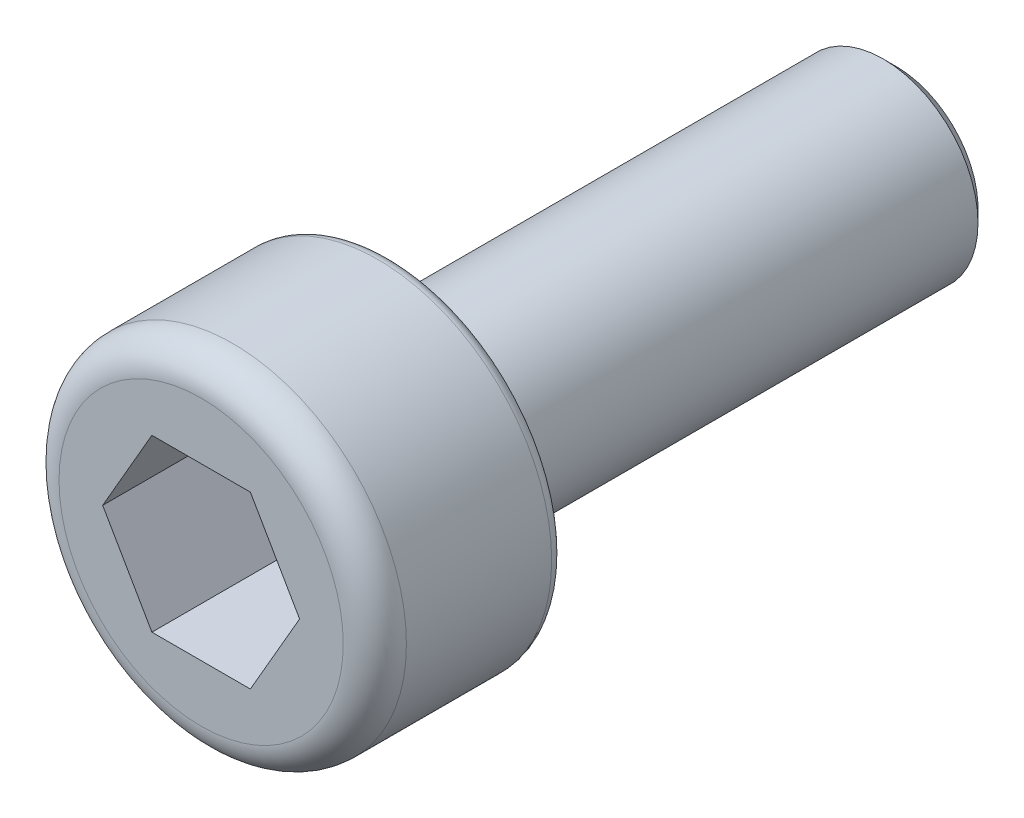
ISO-10303-21;
HEADER;
FILE_DESCRIPTION(('STEP AP214'),'2;1');
FILE_NAME('part.step','',(''),(''),'','','');
FILE_SCHEMA(('AUTOMOTIVE_DESIGN { 1 0 10303 214 1 1 1 1 }'));
ENDSEC;
DATA;
#1=APPLICATION_CONTEXT('core data for automotive mechanical design processes');
#2=APPLICATION_PROTOCOL_DEFINITION('international standard','automotive_design',2000,#1);
#3=PRODUCT_CONTEXT('',#1,'mechanical');
#4=PRODUCT('Part','Part','',(#3));
#5=PRODUCT_RELATED_PRODUCT_CATEGORY('part','',(#4));
#6=PRODUCT_DEFINITION_FORMATION('','',#4);
#7=PRODUCT_DEFINITION_CONTEXT('part definition',#1,'design');
#8=PRODUCT_DEFINITION('design','',#6,#7);
#9=PRODUCT_DEFINITION_SHAPE('','',#8);
#10=(LENGTH_UNIT() NAMED_UNIT(*) SI_UNIT(.MILLI.,.METRE.));
#11=(NAMED_UNIT(*) PLANE_ANGLE_UNIT() SI_UNIT($,.RADIAN.));
#12=(NAMED_UNIT(*) SI_UNIT($,.STERADIAN.) SOLID_ANGLE_UNIT());
#13=UNCERTAINTY_MEASURE_WITH_UNIT(LENGTH_MEASURE(1.E-05),#10,'distance_accuracy_value','');
#14=(GEOMETRIC_REPRESENTATION_CONTEXT(3) GLOBAL_UNCERTAINTY_ASSIGNED_CONTEXT((#13)) GLOBAL_UNIT_ASSIGNED_CONTEXT((#10,
#11,#12)) REPRESENTATION_CONTEXT('',''));
#15=CARTESIAN_POINT('',(0.,0.,0.));
#16=DIRECTION('',(0.,0.,1.));
#17=DIRECTION('',(1.,0.,0.));
#18=AXIS2_PLACEMENT_3D('',#15,#16,#17);
#19=CARTESIAN_POINT('',(0.,0.,0.));
#20=DIRECTION('',(0.,0.,1.));
#21=DIRECTION('',(1.,0.,0.));
#22=AXIS2_PLACEMENT_3D('',#19,#20,#21);
#23=PLANE('',#22);
#24=CARTESIAN_POINT('',(0.,0.,0.));
#25=DIRECTION('',(0.,0.,1.));
#26=DIRECTION('',(1.,0.,0.));
#27=AXIS2_PLACEMENT_3D('',#24,#25,#26);
#28=CIRCLE('',#27,2.55);
#29=CARTESIAN_POINT('',(2.55,0.,0.));
#30=VERTEX_POINT('',#29);
#31=EDGE_CURVE('E11',#30,#30,#28,.F.);
#32=ORIENTED_EDGE('',*,*,#31,.T.);
#33=EDGE_LOOP('',(#32));
#34=FACE_BOUND('',#33,.T.);
#35=CARTESIAN_POINT('',(0.,0.,0.));
#36=DIRECTION('',(0.,0.,1.));
#37=DIRECTION('',(1.,0.,0.));
#38=AXIS2_PLACEMENT_3D('',#35,#36,#37);
#39=CIRCLE('',#38,1.5);
#40=CARTESIAN_POINT('',(1.5,0.,0.));
#41=VERTEX_POINT('',#40);
#42=EDGE_CURVE('E147',#41,#41,#39,.F.);
#43=ORIENTED_EDGE('',*,*,#42,.F.);
#44=EDGE_LOOP('',(#43));
#45=FACE_BOUND('',#44,.T.);
#46=ADVANCED_FACE('F34',(#34,#45),#23,.F.);
#47=CARTESIAN_POINT('',(0.,0.,3.));
#48=DIRECTION('',(0.,0.,-1.));
#49=DIRECTION('',(-1.,0.,0.));
#50=AXIS2_PLACEMENT_3D('',#47,#48,#49);
#51=CYLINDRICAL_SURFACE('',#50,2.75);
#52=CARTESIAN_POINT('',(0.,0.,0.2));
#53=DIRECTION('',(0.,0.,1.));
#54=DIRECTION('',(1.,0.,0.));
#55=AXIS2_PLACEMENT_3D('',#52,#53,#54);
#56=CIRCLE('',#55,2.75);
#57=CARTESIAN_POINT('',(2.75,0.,0.2));
#58=VERTEX_POINT('',#57);
#59=EDGE_CURVE('E42',#58,#58,#56,.T.);
#60=ORIENTED_EDGE('',*,*,#59,.T.);
#61=EDGE_LOOP('',(#60));
#62=FACE_BOUND('',#61,.T.);
#63=CARTESIAN_POINT('',(0.,0.,2.5));
#64=DIRECTION('',(0.,0.,1.));
#65=DIRECTION('',(1.,0.,0.));
#66=AXIS2_PLACEMENT_3D('',#63,#64,#65);
#67=CIRCLE('',#66,2.75);
#68=CARTESIAN_POINT('',(2.75,0.,2.5));
#69=VERTEX_POINT('',#68);
#70=EDGE_CURVE('E144',#69,#69,#67,.F.);
#71=ORIENTED_EDGE('',*,*,#70,.T.);
#72=EDGE_LOOP('',(#71));
#73=FACE_BOUND('',#72,.T.);
#74=ADVANCED_FACE('F158',(#62,#73),#51,.T.);
#75=CARTESIAN_POINT('',(0.,0.,3.));
#76=DIRECTION('',(0.,0.,1.));
#77=DIRECTION('',(1.,0.,0.));
#78=AXIS2_PLACEMENT_3D('',#75,#76,#77);
#79=PLANE('',#78);
#80=DIRECTION('',(0.5,0.866025403784439,0.));
#81=VECTOR('',#80,1.);
#82=CARTESIAN_POINT('',(0.779422863405995,-1.35,3.));
#83=LINE('',#82,#81);
#84=CARTESIAN_POINT('',(0.779422863405995,-1.35,3.));
#85=VERTEX_POINT('',#84);
#86=CARTESIAN_POINT('',(1.55884572681199,0.,3.));
#87=VERTEX_POINT('',#86);
#88=EDGE_CURVE('E49',#85,#87,#83,.T.);
#89=ORIENTED_EDGE('',*,*,#88,.F.);
#90=DIRECTION('',(1.,0.,0.));
#91=VECTOR('',#90,1.);
#92=CARTESIAN_POINT('',(-0.779422863405994,-1.35,3.));
#93=LINE('',#92,#91);
#94=CARTESIAN_POINT('',(-0.779422863405994,-1.35,3.));
#95=VERTEX_POINT('',#94);
#96=EDGE_CURVE('E132',#95,#85,#93,.T.);
#97=ORIENTED_EDGE('',*,*,#96,.F.);
#98=DIRECTION('',(0.5,-0.866025403784438,0.));
#99=VECTOR('',#98,1.);
#100=CARTESIAN_POINT('',(-1.55884572681199,0.,3.));
#101=LINE('',#100,#99);
#102=CARTESIAN_POINT('',(-1.55884572681199,0.,3.));
#103=VERTEX_POINT('',#102);
#104=EDGE_CURVE('E130',#103,#95,#101,.T.);
#105=ORIENTED_EDGE('',*,*,#104,.F.);
#106=DIRECTION('',(-0.5,-0.866025403784438,0.));
#107=VECTOR('',#106,1.);
#108=CARTESIAN_POINT('',(-0.779422863405995,1.35,3.));
#109=LINE('',#108,#107);
#110=CARTESIAN_POINT('',(-0.779422863405995,1.35,3.));
#111=VERTEX_POINT('',#110);
#112=EDGE_CURVE('E97',#111,#103,#109,.T.);
#113=ORIENTED_EDGE('',*,*,#112,.F.);
#114=DIRECTION('',(-1.,0.,0.));
#115=VECTOR('',#114,1.);
#116=CARTESIAN_POINT('',(0.779422863405994,1.35,3.));
#117=LINE('',#116,#115);
#118=CARTESIAN_POINT('',(0.779422863405994,1.35,3.));
#119=VERTEX_POINT('',#118);
#120=EDGE_CURVE('E126',#119,#111,#117,.T.);
#121=ORIENTED_EDGE('',*,*,#120,.F.);
#122=DIRECTION('',(-0.5,0.866025403784438,0.));
#123=VECTOR('',#122,1.);
#124=CARTESIAN_POINT('',(1.55884572681199,0.,3.));
#125=LINE('',#124,#123);
#126=EDGE_CURVE('E123',#87,#119,#125,.T.);
#127=ORIENTED_EDGE('',*,*,#126,.F.);
#128=EDGE_LOOP('',(#89,#97,#105,#113,#121,#127));
#129=FACE_BOUND('',#128,.T.);
#130=CARTESIAN_POINT('',(0.,0.,3.));
#131=DIRECTION('',(0.,0.,1.));
#132=DIRECTION('',(1.,0.,0.));
#133=AXIS2_PLACEMENT_3D('',#130,#131,#132);
#134=CIRCLE('',#133,2.25);
#135=CARTESIAN_POINT('',(2.25,0.,3.));
#136=VERTEX_POINT('',#135);
#137=EDGE_CURVE('E136',#136,#136,#134,.T.);
#138=ORIENTED_EDGE('',*,*,#137,.T.);
#139=EDGE_LOOP('',(#138));
#140=FACE_BOUND('',#139,.T.);
#141=ADVANCED_FACE('F176',(#129,#140),#79,.T.);
#142=CARTESIAN_POINT('',(0.,0.,2.5));
#143=DIRECTION('',(0.,0.,1.));
#144=DIRECTION('',(1.,0.,0.));
#145=AXIS2_PLACEMENT_3D('',#142,#143,#144);
#146=TOROIDAL_SURFACE('',#145,2.25,0.5);
#147=ORIENTED_EDGE('',*,*,#70,.F.);
#148=EDGE_LOOP('',(#147));
#149=FACE_BOUND('',#148,.T.);
#150=ORIENTED_EDGE('',*,*,#137,.F.);
#151=EDGE_LOOP('',(#150));
#152=FACE_BOUND('',#151,.T.);
#153=ADVANCED_FACE('F182',(#149,#152),#146,.T.);
#154=CARTESIAN_POINT('',(0.779422863405995,-1.35,1.));
#155=DIRECTION('',(0.866025403784439,-0.5,0.));
#156=DIRECTION('',(0.5,0.866025403784439,0.));
#157=AXIS2_PLACEMENT_3D('',#154,#155,#156);
#158=PLANE('',#157);
#159=ORIENTED_EDGE('',*,*,#88,.T.);
#160=DIRECTION('',(0.,0.,1.));
#161=VECTOR('',#160,1.);
#162=CARTESIAN_POINT('',(1.55884572681199,0.,1.));
#163=LINE('',#162,#161);
#164=CARTESIAN_POINT('',(1.55884572681199,0.,1.));
#165=VERTEX_POINT('',#164);
#166=EDGE_CURVE('E79',#165,#87,#163,.T.);
#167=ORIENTED_EDGE('',*,*,#166,.F.);
#168=DIRECTION('',(0.5,0.866025403784439,0.));
#169=VECTOR('',#168,1.);
#170=CARTESIAN_POINT('',(0.779422863405995,-1.35,1.));
#171=LINE('',#170,#169);
#172=CARTESIAN_POINT('',(0.779422863405995,-1.35,1.));
#173=VERTEX_POINT('',#172);
#174=EDGE_CURVE('E134',#173,#165,#171,.T.);
#175=ORIENTED_EDGE('',*,*,#174,.F.);
#176=DIRECTION('',(0.,0.,1.));
#177=VECTOR('',#176,1.);
#178=CARTESIAN_POINT('',(0.779422863405995,-1.35,1.));
#179=LINE('',#178,#177);
#180=EDGE_CURVE('E57',#173,#85,#179,.T.);
#181=ORIENTED_EDGE('',*,*,#180,.T.);
#182=EDGE_LOOP('',(#159,#167,#175,#181));
#183=FACE_BOUND('',#182,.T.);
#184=ADVANCED_FACE('F184',(#183),#158,.F.);
#185=CARTESIAN_POINT('',(-0.779422863405994,-1.35,1.));
#186=DIRECTION('',(0.,-1.,0.));
#187=DIRECTION('',(0.,0.,-1.));
#188=AXIS2_PLACEMENT_3D('',#185,#186,#187);
#189=PLANE('',#188);
#190=ORIENTED_EDGE('',*,*,#96,.T.);
#191=ORIENTED_EDGE('',*,*,#180,.F.);
#192=DIRECTION('',(1.,0.,0.));
#193=VECTOR('',#192,1.);
#194=CARTESIAN_POINT('',(-0.779422863405994,-1.35,1.));
#195=LINE('',#194,#193);
#196=CARTESIAN_POINT('',(-0.779422863405994,-1.35,1.));
#197=VERTEX_POINT('',#196);
#198=EDGE_CURVE('E109',#197,#173,#195,.T.);
#199=ORIENTED_EDGE('',*,*,#198,.F.);
#200=DIRECTION('',(0.,0.,1.));
#201=VECTOR('',#200,1.);
#202=CARTESIAN_POINT('',(-0.779422863405994,-1.35,1.));
#203=LINE('',#202,#201);
#204=EDGE_CURVE('E101',#197,#95,#203,.T.);
#205=ORIENTED_EDGE('',*,*,#204,.T.);
#206=EDGE_LOOP('',(#190,#191,#199,#205));
#207=FACE_BOUND('',#206,.T.);
#208=ADVANCED_FACE('F190',(#207),#189,.F.);
#209=CARTESIAN_POINT('',(-1.55884572681199,0.,1.));
#210=DIRECTION('',(-0.866025403784438,-0.5,0.));
#211=DIRECTION('',(0.5,-0.866025403784438,0.));
#212=AXIS2_PLACEMENT_3D('',#209,#210,#211);
#213=PLANE('',#212);
#214=ORIENTED_EDGE('',*,*,#104,.T.);
#215=ORIENTED_EDGE('',*,*,#204,.F.);
#216=DIRECTION('',(0.5,-0.866025403784438,0.));
#217=VECTOR('',#216,1.);
#218=CARTESIAN_POINT('',(-1.55884572681199,0.,1.));
#219=LINE('',#218,#217);
#220=CARTESIAN_POINT('',(-1.55884572681199,0.,1.));
#221=VERTEX_POINT('',#220);
#222=EDGE_CURVE('E105',#221,#197,#219,.T.);
#223=ORIENTED_EDGE('',*,*,#222,.F.);
#224=DIRECTION('',(0.,0.,1.));
#225=VECTOR('',#224,1.);
#226=CARTESIAN_POINT('',(-1.55884572681199,0.,1.));
#227=LINE('',#226,#225);
#228=EDGE_CURVE('E90',#221,#103,#227,.T.);
#229=ORIENTED_EDGE('',*,*,#228,.T.);
#230=EDGE_LOOP('',(#214,#215,#223,#229));
#231=FACE_BOUND('',#230,.T.);
#232=ADVANCED_FACE('F106',(#231),#213,.F.);
#233=CARTESIAN_POINT('',(-0.779422863405995,1.35,1.));
#234=DIRECTION('',(-0.866025403784439,0.5,0.));
#235=DIRECTION('',(-0.5,-0.866025403784439,0.));
#236=AXIS2_PLACEMENT_3D('',#233,#234,#235);
#237=PLANE('',#236);
#238=ORIENTED_EDGE('',*,*,#112,.T.);
#239=ORIENTED_EDGE('',*,*,#228,.F.);
#240=DIRECTION('',(-0.5,-0.866025403784438,0.));
#241=VECTOR('',#240,1.);
#242=CARTESIAN_POINT('',(-0.779422863405995,1.35,1.));
#243=LINE('',#242,#241);
#244=CARTESIAN_POINT('',(-0.779422863405995,1.35,1.));
#245=VERTEX_POINT('',#244);
#246=EDGE_CURVE('E94',#245,#221,#243,.T.);
#247=ORIENTED_EDGE('',*,*,#246,.F.);
#248=DIRECTION('',(0.,0.,1.));
#249=VECTOR('',#248,1.);
#250=CARTESIAN_POINT('',(-0.779422863405995,1.35,1.));
#251=LINE('',#250,#249);
#252=EDGE_CURVE('E102',#245,#111,#251,.T.);
#253=ORIENTED_EDGE('',*,*,#252,.T.);
#254=EDGE_LOOP('',(#238,#239,#247,#253));
#255=FACE_BOUND('',#254,.T.);
#256=ADVANCED_FACE('F92',(#255),#237,.F.);
#257=CARTESIAN_POINT('',(0.779422863405994,1.35,1.));
#258=DIRECTION('',(0.,1.,0.));
#259=DIRECTION('',(0.,0.,1.));
#260=AXIS2_PLACEMENT_3D('',#257,#258,#259);
#261=PLANE('',#260);
#262=ORIENTED_EDGE('',*,*,#120,.T.);
#263=ORIENTED_EDGE('',*,*,#252,.F.);
#264=DIRECTION('',(-1.,0.,0.));
#265=VECTOR('',#264,1.);
#266=CARTESIAN_POINT('',(0.779422863405994,1.35,1.));
#267=LINE('',#266,#265);
#268=CARTESIAN_POINT('',(0.779422863405994,1.35,1.));
#269=VERTEX_POINT('',#268);
#270=EDGE_CURVE('E115',#269,#245,#267,.T.);
#271=ORIENTED_EDGE('',*,*,#270,.F.);
#272=DIRECTION('',(0.,0.,1.));
#273=VECTOR('',#272,1.);
#274=CARTESIAN_POINT('',(0.779422863405994,1.35,1.));
#275=LINE('',#274,#273);
#276=EDGE_CURVE('E139',#269,#119,#275,.T.);
#277=ORIENTED_EDGE('',*,*,#276,.T.);
#278=EDGE_LOOP('',(#262,#263,#271,#277));
#279=FACE_BOUND('',#278,.T.);
#280=ADVANCED_FACE('F215',(#279),#261,.F.);
#281=CARTESIAN_POINT('',(1.55884572681199,0.,1.));
#282=DIRECTION('',(0.866025403784438,0.5,0.));
#283=DIRECTION('',(-0.5,0.866025403784438,0.));
#284=AXIS2_PLACEMENT_3D('',#281,#282,#283);
#285=PLANE('',#284);
#286=ORIENTED_EDGE('',*,*,#126,.T.);
#287=ORIENTED_EDGE('',*,*,#276,.F.);
#288=DIRECTION('',(-0.5,0.866025403784438,0.));
#289=VECTOR('',#288,1.);
#290=CARTESIAN_POINT('',(1.55884572681199,0.,1.));
#291=LINE('',#290,#289);
#292=EDGE_CURVE('E117',#165,#269,#291,.T.);
#293=ORIENTED_EDGE('',*,*,#292,.F.);
#294=ORIENTED_EDGE('',*,*,#166,.T.);
#295=EDGE_LOOP('',(#286,#287,#293,#294));
#296=FACE_BOUND('',#295,.T.);
#297=ADVANCED_FACE('F202',(#296),#285,.F.);
#298=CARTESIAN_POINT('',(0.,0.,1.));
#299=DIRECTION('',(0.,0.,1.));
#300=DIRECTION('',(1.,0.,0.));
#301=AXIS2_PLACEMENT_3D('',#298,#299,#300);
#302=PLANE('',#301);
#303=ORIENTED_EDGE('',*,*,#174,.T.);
#304=ORIENTED_EDGE('',*,*,#292,.T.);
#305=ORIENTED_EDGE('',*,*,#270,.T.);
#306=ORIENTED_EDGE('',*,*,#246,.T.);
#307=ORIENTED_EDGE('',*,*,#222,.T.);
#308=ORIENTED_EDGE('',*,*,#198,.T.);
#309=EDGE_LOOP('',(#303,#304,#305,#306,#307,#308));
#310=FACE_BOUND('',#309,.T.);
#311=ADVANCED_FACE('F112',(#310),#302,.T.);
#312=CARTESIAN_POINT('',(0.,0.,-8.));
#313=DIRECTION('',(0.,0.,1.));
#314=DIRECTION('',(1.,0.,0.));
#315=AXIS2_PLACEMENT_3D('',#312,#313,#314);
#316=CYLINDRICAL_SURFACE('',#315,1.5);
#317=CARTESIAN_POINT('',(0.,0.,-7.8));
#318=DIRECTION('',(0.,0.,-1.));
#319=DIRECTION('',(-1.,0.,0.));
#320=AXIS2_PLACEMENT_3D('',#317,#318,#319);
#321=CIRCLE('',#320,1.5);
#322=CARTESIAN_POINT('',(-1.5,0.,-7.8));
#323=VERTEX_POINT('',#322);
#324=EDGE_CURVE('E153',#323,#323,#321,.F.);
#325=ORIENTED_EDGE('',*,*,#324,.T.);
#326=EDGE_LOOP('',(#325));
#327=FACE_BOUND('',#326,.T.);
#328=ORIENTED_EDGE('',*,*,#42,.T.);
#329=EDGE_LOOP('',(#328));
#330=FACE_BOUND('',#329,.T.);
#331=ADVANCED_FACE('F223',(#327,#330),#316,.T.);
#332=CARTESIAN_POINT('',(0.,0.,-8.));
#333=DIRECTION('',(0.,0.,-1.));
#334=DIRECTION('',(-1.,0.,0.));
#335=AXIS2_PLACEMENT_3D('',#332,#333,#334);
#336=PLANE('',#335);
#337=CARTESIAN_POINT('',(0.,0.,-8.));
#338=DIRECTION('',(0.,0.,-1.));
#339=DIRECTION('',(-1.,0.,0.));
#340=AXIS2_PLACEMENT_3D('',#337,#338,#339);
#341=CIRCLE('',#340,1.3);
#342=CARTESIAN_POINT('',(-1.3,0.,-8.));
#343=VERTEX_POINT('',#342);
#344=EDGE_CURVE('E150',#343,#343,#341,.T.);
#345=ORIENTED_EDGE('',*,*,#344,.T.);
#346=EDGE_LOOP('',(#345));
#347=FACE_BOUND('',#346,.T.);
#348=ADVANCED_FACE('F167',(#347),#336,.T.);
#349=CARTESIAN_POINT('',(0.,0.,-8.));
#350=DIRECTION('',(0.,0.,1.));
#351=DIRECTION('',(1.,0.,0.));
#352=AXIS2_PLACEMENT_3D('',#349,#350,#351);
#353=CONICAL_SURFACE('',#352,1.3,0.78539816339745);
#354=ORIENTED_EDGE('',*,*,#324,.F.);
#355=EDGE_LOOP('',(#354));
#356=FACE_BOUND('',#355,.T.);
#357=ORIENTED_EDGE('',*,*,#344,.F.);
#358=EDGE_LOOP('',(#357));
#359=FACE_BOUND('',#358,.T.);
#360=ADVANCED_FACE('F162',(#356,#359),#353,.T.);
#361=CARTESIAN_POINT('',(0.,0.,0.2));
#362=DIRECTION('',(0.,0.,1.));
#363=DIRECTION('',(1.,0.,0.));
#364=AXIS2_PLACEMENT_3D('',#361,#362,#363);
#365=TOROIDAL_SURFACE('',#364,2.55,0.2);
#366=ORIENTED_EDGE('',*,*,#31,.F.);
#367=EDGE_LOOP('',(#366));
#368=FACE_BOUND('',#367,.T.);
#369=ORIENTED_EDGE('',*,*,#59,.F.);
#370=EDGE_LOOP('',(#369));
#371=FACE_BOUND('',#370,.T.);
#372=ADVANCED_FACE('F36',(#368,#371),#365,.T.);
#373=CLOSED_SHELL('',(#46,#74,#141,#153,#184,#208,#232,#256,#280,#297,#311,#331,#348,#360,#372));
#374=MANIFOLD_SOLID_BREP('B2',#373);
#375=ADVANCED_BREP_SHAPE_REPRESENTATION('',(#18,#374),#14);
#376=SHAPE_DEFINITION_REPRESENTATION(#9,#375);
ENDSEC;
END-ISO-10303-21;
